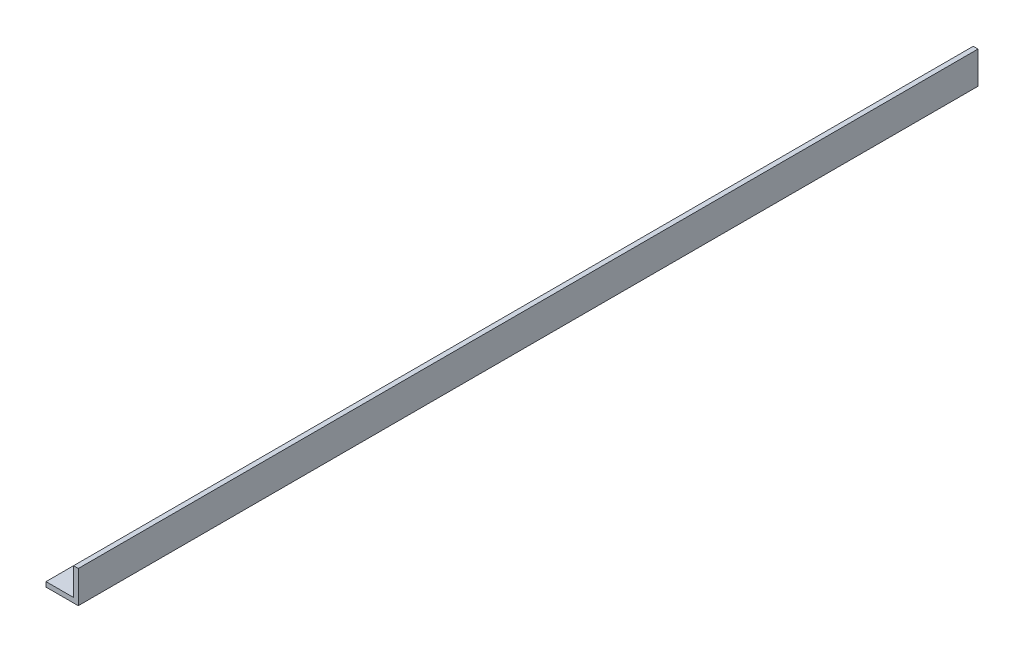
ISO-10303-21;
HEADER;
FILE_DESCRIPTION(('STEP AP214'),'2;1');
FILE_NAME('part.step','',(''),(''),'','','');
FILE_SCHEMA(('AUTOMOTIVE_DESIGN { 1 0 10303 214 1 1 1 1 }'));
ENDSEC;
DATA;
#1=APPLICATION_CONTEXT('core data for automotive mechanical design processes');
#2=APPLICATION_PROTOCOL_DEFINITION('international standard','automotive_design',2000,#1);
#3=PRODUCT_CONTEXT('',#1,'mechanical');
#4=PRODUCT('Part','Part','',(#3));
#5=PRODUCT_RELATED_PRODUCT_CATEGORY('part','',(#4));
#6=PRODUCT_DEFINITION_FORMATION('','',#4);
#7=PRODUCT_DEFINITION_CONTEXT('part definition',#1,'design');
#8=PRODUCT_DEFINITION('design','',#6,#7);
#9=PRODUCT_DEFINITION_SHAPE('','',#8);
#10=(LENGTH_UNIT() NAMED_UNIT(*) SI_UNIT(.MILLI.,.METRE.));
#11=(NAMED_UNIT(*) PLANE_ANGLE_UNIT() SI_UNIT($,.RADIAN.));
#12=(NAMED_UNIT(*) SI_UNIT($,.STERADIAN.) SOLID_ANGLE_UNIT());
#13=UNCERTAINTY_MEASURE_WITH_UNIT(LENGTH_MEASURE(1.E-05),#10,'distance_accuracy_value','');
#14=(GEOMETRIC_REPRESENTATION_CONTEXT(3) GLOBAL_UNCERTAINTY_ASSIGNED_CONTEXT((#13)) GLOBAL_UNIT_ASSIGNED_CONTEXT((#10,
#11,#12)) REPRESENTATION_CONTEXT('',''));
#15=CARTESIAN_POINT('',(0.,0.,0.));
#16=DIRECTION('',(0.,0.,1.));
#17=DIRECTION('',(1.,0.,0.));
#18=AXIS2_PLACEMENT_3D('',#15,#16,#17);
#19=CARTESIAN_POINT('',(0.,4.,753.));
#20=DIRECTION('',(1.,0.,0.));
#21=DIRECTION('',(0.,0.,-1.));
#22=AXIS2_PLACEMENT_3D('',#19,#20,#21);
#23=PLANE('',#22);
#24=DIRECTION('',(0.,-1.,0.));
#25=VECTOR('',#24,1.);
#26=CARTESIAN_POINT('',(0.,4.,0.));
#27=LINE('',#26,#25);
#28=CARTESIAN_POINT('',(0.,4.,0.));
#29=VERTEX_POINT('',#28);
#30=CARTESIAN_POINT('',(0.,0.,0.));
#31=VERTEX_POINT('',#30);
#32=EDGE_CURVE('E117',#29,#31,#27,.T.);
#33=ORIENTED_EDGE('',*,*,#32,.T.);
#34=DIRECTION('',(0.,0.,-1.));
#35=VECTOR('',#34,1.);
#36=CARTESIAN_POINT('',(0.,0.,753.));
#37=LINE('',#36,#35);
#38=CARTESIAN_POINT('',(0.,0.,753.));
#39=VERTEX_POINT('',#38);
#40=EDGE_CURVE('E11',#39,#31,#37,.T.);
#41=ORIENTED_EDGE('',*,*,#40,.F.);
#42=DIRECTION('',(0.,-1.,0.));
#43=VECTOR('',#42,1.);
#44=CARTESIAN_POINT('',(0.,4.,753.));
#45=LINE('',#44,#43);
#46=CARTESIAN_POINT('',(0.,4.,753.));
#47=VERTEX_POINT('',#46);
#48=EDGE_CURVE('E127',#47,#39,#45,.T.);
#49=ORIENTED_EDGE('',*,*,#48,.F.);
#50=DIRECTION('',(0.,0.,-1.));
#51=VECTOR('',#50,1.);
#52=CARTESIAN_POINT('',(0.,4.,753.));
#53=LINE('',#52,#51);
#54=EDGE_CURVE('E113',#47,#29,#53,.T.);
#55=ORIENTED_EDGE('',*,*,#54,.T.);
#56=EDGE_LOOP('',(#33,#41,#49,#55));
#57=FACE_BOUND('',#56,.T.);
#58=ADVANCED_FACE('F33',(#57),#23,.F.);
#59=CARTESIAN_POINT('',(0.,0.,753.));
#60=DIRECTION('',(0.,1.,0.));
#61=DIRECTION('',(0.,0.,1.));
#62=AXIS2_PLACEMENT_3D('',#59,#60,#61);
#63=PLANE('',#62);
#64=DIRECTION('',(1.,0.,0.));
#65=VECTOR('',#64,1.);
#66=CARTESIAN_POINT('',(0.,0.,0.));
#67=LINE('',#66,#65);
#68=CARTESIAN_POINT('',(27.,0.,0.));
#69=VERTEX_POINT('',#68);
#70=EDGE_CURVE('E120',#31,#69,#67,.T.);
#71=ORIENTED_EDGE('',*,*,#70,.T.);
#72=DIRECTION('',(0.,0.,-1.));
#73=VECTOR('',#72,1.);
#74=CARTESIAN_POINT('',(27.,0.,753.));
#75=LINE('',#74,#73);
#76=CARTESIAN_POINT('',(27.,0.,753.));
#77=VERTEX_POINT('',#76);
#78=EDGE_CURVE('E41',#77,#69,#75,.T.);
#79=ORIENTED_EDGE('',*,*,#78,.F.);
#80=DIRECTION('',(1.,0.,0.));
#81=VECTOR('',#80,1.);
#82=CARTESIAN_POINT('',(0.,0.,753.));
#83=LINE('',#82,#81);
#84=EDGE_CURVE('E86',#39,#77,#83,.T.);
#85=ORIENTED_EDGE('',*,*,#84,.F.);
#86=ORIENTED_EDGE('',*,*,#40,.T.);
#87=EDGE_LOOP('',(#71,#79,#85,#86));
#88=FACE_BOUND('',#87,.T.);
#89=ADVANCED_FACE('F151',(#88),#63,.F.);
#90=CARTESIAN_POINT('',(27.,0.,753.));
#91=DIRECTION('',(-1.,0.,0.));
#92=DIRECTION('',(0.,0.,1.));
#93=AXIS2_PLACEMENT_3D('',#90,#91,#92);
#94=PLANE('',#93);
#95=DIRECTION('',(0.,1.,0.));
#96=VECTOR('',#95,1.);
#97=CARTESIAN_POINT('',(27.,0.,0.));
#98=LINE('',#97,#96);
#99=CARTESIAN_POINT('',(27.,27.,0.));
#100=VERTEX_POINT('',#99);
#101=EDGE_CURVE('E122',#69,#100,#98,.T.);
#102=ORIENTED_EDGE('',*,*,#101,.T.);
#103=DIRECTION('',(0.,0.,-1.));
#104=VECTOR('',#103,1.);
#105=CARTESIAN_POINT('',(27.,27.,753.));
#106=LINE('',#105,#104);
#107=CARTESIAN_POINT('',(27.,27.,753.));
#108=VERTEX_POINT('',#107);
#109=EDGE_CURVE('E108',#108,#100,#106,.T.);
#110=ORIENTED_EDGE('',*,*,#109,.F.);
#111=DIRECTION('',(0.,1.,0.));
#112=VECTOR('',#111,1.);
#113=CARTESIAN_POINT('',(27.,0.,753.));
#114=LINE('',#113,#112);
#115=EDGE_CURVE('E99',#77,#108,#114,.T.);
#116=ORIENTED_EDGE('',*,*,#115,.F.);
#117=ORIENTED_EDGE('',*,*,#78,.T.);
#118=EDGE_LOOP('',(#102,#110,#116,#117));
#119=FACE_BOUND('',#118,.T.);
#120=ADVANCED_FACE('F133',(#119),#94,.F.);
#121=CARTESIAN_POINT('',(23.,27.,753.));
#122=DIRECTION('',(0.,-1.,0.));
#123=DIRECTION('',(0.,0.,-1.));
#124=AXIS2_PLACEMENT_3D('',#121,#122,#123);
#125=PLANE('',#124);
#126=DIRECTION('',(-1.,0.,0.));
#127=VECTOR('',#126,1.);
#128=CARTESIAN_POINT('',(23.,27.,0.));
#129=LINE('',#128,#127);
#130=CARTESIAN_POINT('',(23.,27.,0.));
#131=VERTEX_POINT('',#130);
#132=EDGE_CURVE('E107',#100,#131,#129,.T.);
#133=ORIENTED_EDGE('',*,*,#132,.T.);
#134=DIRECTION('',(0.,0.,-1.));
#135=VECTOR('',#134,1.);
#136=CARTESIAN_POINT('',(23.,27.,753.));
#137=LINE('',#136,#135);
#138=CARTESIAN_POINT('',(23.,27.,753.));
#139=VERTEX_POINT('',#138);
#140=EDGE_CURVE('E104',#139,#131,#137,.T.);
#141=ORIENTED_EDGE('',*,*,#140,.F.);
#142=DIRECTION('',(-1.,0.,0.));
#143=VECTOR('',#142,1.);
#144=CARTESIAN_POINT('',(23.,27.,753.));
#145=LINE('',#144,#143);
#146=EDGE_CURVE('E93',#108,#139,#145,.T.);
#147=ORIENTED_EDGE('',*,*,#146,.F.);
#148=ORIENTED_EDGE('',*,*,#109,.T.);
#149=EDGE_LOOP('',(#133,#141,#147,#148));
#150=FACE_BOUND('',#149,.T.);
#151=ADVANCED_FACE('F105',(#150),#125,.F.);
#152=CARTESIAN_POINT('',(23.,4.,753.));
#153=DIRECTION('',(1.,0.,0.));
#154=DIRECTION('',(0.,0.,-1.));
#155=AXIS2_PLACEMENT_3D('',#152,#153,#154);
#156=PLANE('',#155);
#157=DIRECTION('',(0.,-1.,0.));
#158=VECTOR('',#157,1.);
#159=CARTESIAN_POINT('',(23.,4.,0.));
#160=LINE('',#159,#158);
#161=CARTESIAN_POINT('',(23.,4.,0.));
#162=VERTEX_POINT('',#161);
#163=EDGE_CURVE('E72',#131,#162,#160,.T.);
#164=ORIENTED_EDGE('',*,*,#163,.T.);
#165=DIRECTION('',(0.,0.,-1.));
#166=VECTOR('',#165,1.);
#167=CARTESIAN_POINT('',(23.,4.,753.));
#168=LINE('',#167,#166);
#169=CARTESIAN_POINT('',(23.,4.,753.));
#170=VERTEX_POINT('',#169);
#171=EDGE_CURVE('E109',#170,#162,#168,.T.);
#172=ORIENTED_EDGE('',*,*,#171,.F.);
#173=DIRECTION('',(0.,-1.,0.));
#174=VECTOR('',#173,1.);
#175=CARTESIAN_POINT('',(23.,4.,753.));
#176=LINE('',#175,#174);
#177=EDGE_CURVE('E97',#139,#170,#176,.T.);
#178=ORIENTED_EDGE('',*,*,#177,.F.);
#179=ORIENTED_EDGE('',*,*,#140,.T.);
#180=EDGE_LOOP('',(#164,#172,#178,#179));
#181=FACE_BOUND('',#180,.T.);
#182=ADVANCED_FACE('F111',(#181),#156,.F.);
#183=CARTESIAN_POINT('',(0.,4.,753.));
#184=DIRECTION('',(0.,-1.,0.));
#185=DIRECTION('',(0.,0.,-1.));
#186=AXIS2_PLACEMENT_3D('',#183,#184,#185);
#187=PLANE('',#186);
#188=DIRECTION('',(-1.,0.,0.));
#189=VECTOR('',#188,1.);
#190=CARTESIAN_POINT('',(0.,4.,0.));
#191=LINE('',#190,#189);
#192=EDGE_CURVE('E78',#162,#29,#191,.T.);
#193=ORIENTED_EDGE('',*,*,#192,.T.);
#194=ORIENTED_EDGE('',*,*,#54,.F.);
#195=DIRECTION('',(-1.,0.,0.));
#196=VECTOR('',#195,1.);
#197=CARTESIAN_POINT('',(0.,4.,753.));
#198=LINE('',#197,#196);
#199=EDGE_CURVE('E49',#170,#47,#198,.T.);
#200=ORIENTED_EDGE('',*,*,#199,.F.);
#201=ORIENTED_EDGE('',*,*,#171,.T.);
#202=EDGE_LOOP('',(#193,#194,#200,#201));
#203=FACE_BOUND('',#202,.T.);
#204=ADVANCED_FACE('F140',(#203),#187,.F.);
#205=CARTESIAN_POINT('',(0.,0.,753.));
#206=DIRECTION('',(0.,0.,1.));
#207=DIRECTION('',(1.,0.,0.));
#208=AXIS2_PLACEMENT_3D('',#205,#206,#207);
#209=PLANE('',#208);
#210=ORIENTED_EDGE('',*,*,#48,.T.);
#211=ORIENTED_EDGE('',*,*,#84,.T.);
#212=ORIENTED_EDGE('',*,*,#115,.T.);
#213=ORIENTED_EDGE('',*,*,#146,.T.);
#214=ORIENTED_EDGE('',*,*,#177,.T.);
#215=ORIENTED_EDGE('',*,*,#199,.T.);
#216=EDGE_LOOP('',(#210,#211,#212,#213,#214,#215));
#217=FACE_BOUND('',#216,.T.);
#218=ADVANCED_FACE('F95',(#217),#209,.T.);
#219=CARTESIAN_POINT('',(0.,0.,0.));
#220=DIRECTION('',(0.,0.,1.));
#221=DIRECTION('',(1.,0.,0.));
#222=AXIS2_PLACEMENT_3D('',#219,#220,#221);
#223=PLANE('',#222);
#224=ORIENTED_EDGE('',*,*,#32,.F.);
#225=ORIENTED_EDGE('',*,*,#192,.F.);
#226=ORIENTED_EDGE('',*,*,#163,.F.);
#227=ORIENTED_EDGE('',*,*,#132,.F.);
#228=ORIENTED_EDGE('',*,*,#101,.F.);
#229=ORIENTED_EDGE('',*,*,#70,.F.);
#230=EDGE_LOOP('',(#224,#225,#226,#227,#228,#229));
#231=FACE_BOUND('',#230,.T.);
#232=ADVANCED_FACE('F136',(#231),#223,.F.);
#233=CLOSED_SHELL('',(#58,#89,#120,#151,#182,#204,#218,#232));
#234=MANIFOLD_SOLID_BREP('B2',#233);
#235=ADVANCED_BREP_SHAPE_REPRESENTATION('',(#18,#234),#14);
#236=SHAPE_DEFINITION_REPRESENTATION(#9,#235);
ENDSEC;
END-ISO-10303-21;
